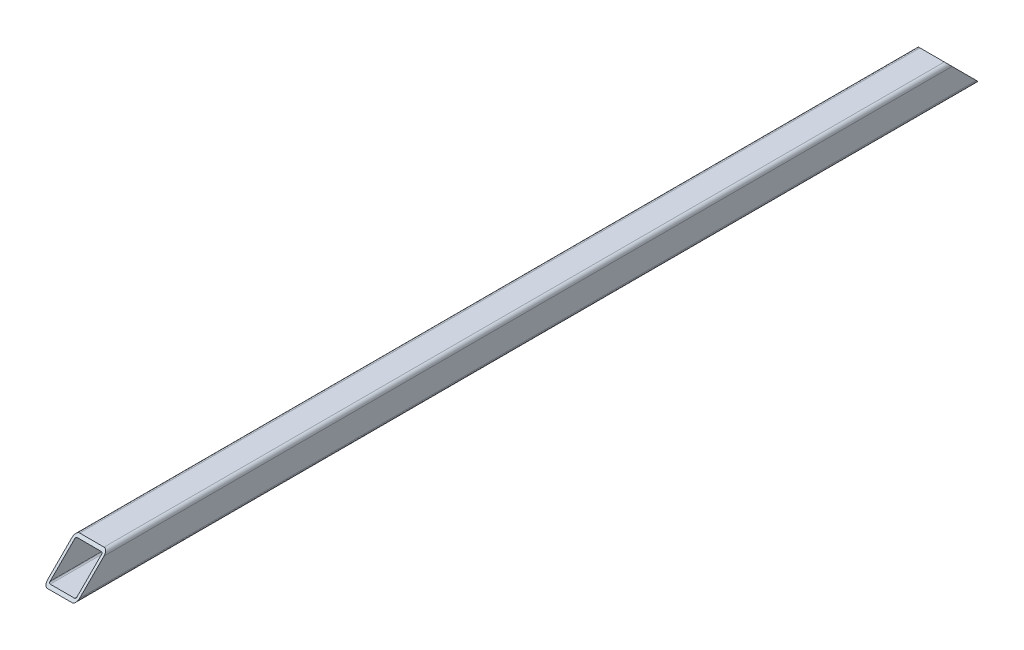
ISO-10303-21;
HEADER;
FILE_DESCRIPTION(('STEP AP214'),'2;1');
FILE_NAME('part.step','',(''),(''),'','','');
FILE_SCHEMA(('AUTOMOTIVE_DESIGN { 1 0 10303 214 1 1 1 1 }'));
ENDSEC;
DATA;
#1=APPLICATION_CONTEXT('core data for automotive mechanical design processes');
#2=APPLICATION_PROTOCOL_DEFINITION('international standard','automotive_design',2000,#1);
#3=PRODUCT_CONTEXT('',#1,'mechanical');
#4=PRODUCT('Part','Part','',(#3));
#5=PRODUCT_RELATED_PRODUCT_CATEGORY('part','',(#4));
#6=PRODUCT_DEFINITION_FORMATION('','',#4);
#7=PRODUCT_DEFINITION_CONTEXT('part definition',#1,'design');
#8=PRODUCT_DEFINITION('design','',#6,#7);
#9=PRODUCT_DEFINITION_SHAPE('','',#8);
#10=(LENGTH_UNIT() NAMED_UNIT(*) SI_UNIT(.MILLI.,.METRE.));
#11=(NAMED_UNIT(*) PLANE_ANGLE_UNIT() SI_UNIT($,.RADIAN.));
#12=(NAMED_UNIT(*) SI_UNIT($,.STERADIAN.) SOLID_ANGLE_UNIT());
#13=UNCERTAINTY_MEASURE_WITH_UNIT(LENGTH_MEASURE(1.E-05),#10,'distance_accuracy_value','');
#14=(GEOMETRIC_REPRESENTATION_CONTEXT(3) GLOBAL_UNCERTAINTY_ASSIGNED_CONTEXT((#13)) GLOBAL_UNIT_ASSIGNED_CONTEXT((#10,
#11,#12)) REPRESENTATION_CONTEXT('',''));
#15=CARTESIAN_POINT('',(0.,0.,0.));
#16=DIRECTION('',(0.,0.,1.));
#17=DIRECTION('',(1.,0.,0.));
#18=AXIS2_PLACEMENT_3D('',#15,#16,#17);
#19=CARTESIAN_POINT('',(-9.49999999999648,-9.50000000000021,1.05693231944315E-12));
#20=DIRECTION('',(0.,0.,1.));
#21=DIRECTION('',(1.,0.,0.));
#22=AXIS2_PLACEMENT_3D('',#19,#20,#21);
#23=CYLINDRICAL_SURFACE('',#22,3.);
#24=CARTESIAN_POINT('',(-9.49999999999648,-9.50000000000021,-9.49999999773317));
#25=DIRECTION('',(0.,-0.707106781102224,0.707106781270871));
#26=DIRECTION('',(0.,0.707106781270871,0.707106781102224));
#27=AXIS2_PLACEMENT_3D('',#24,#25,#26);
#28=ELLIPSE('',#27,4.24264068661334,3.);
#29=CARTESIAN_POINT('',(-12.4999999999964,-9.50000000000021,-9.49999999773315));
#30=VERTEX_POINT('',#29);
#31=CARTESIAN_POINT('',(-9.49999999999648,-12.5000000000002,-12.5000000999989));
#32=VERTEX_POINT('',#31);
#33=EDGE_CURVE('E211',#30,#32,#28,.T.);
#34=ORIENTED_EDGE('',*,*,#33,.T.);
#35=DIRECTION('',(0.,0.,1.));
#36=VECTOR('',#35,1.);
#37=CARTESIAN_POINT('',(-9.49999999999648,-12.5000000000002,1.05693231944315E-12));
#38=LINE('',#37,#36);
#39=CARTESIAN_POINT('',(-9.49999999999356,-12.5000000000002,692.500000100001));
#40=VERTEX_POINT('',#39);
#41=EDGE_CURVE('E11',#32,#40,#38,.T.);
#42=ORIENTED_EDGE('',*,*,#41,.T.);
#43=CARTESIAN_POINT('',(-9.49999999999363,-9.50000000000021,689.500000003603));
#44=DIRECTION('',(0.,-0.707106781320614,-0.707106781052481));
#45=DIRECTION('',(0.,0.707106781052481,-0.707106781320614));
#46=AXIS2_PLACEMENT_3D('',#43,#44,#45);
#47=ELLIPSE('',#46,4.24264068792368,3.);
#48=CARTESIAN_POINT('',(-12.4999999999936,-9.50000000000021,689.500000003603));
#49=VERTEX_POINT('',#48);
#50=EDGE_CURVE('E278',#40,#49,#47,.T.);
#51=ORIENTED_EDGE('',*,*,#50,.T.);
#52=DIRECTION('',(0.,0.,-1.));
#53=VECTOR('',#52,1.);
#54=CARTESIAN_POINT('',(-12.4999999999964,-9.50000000000021,1.06581410364015E-12));
#55=LINE('',#54,#53);
#56=EDGE_CURVE('E267',#49,#30,#55,.T.);
#57=ORIENTED_EDGE('',*,*,#56,.T.);
#58=EDGE_LOOP('',(#34,#42,#51,#57));
#59=FACE_BOUND('',#58,.T.);
#60=ADVANCED_FACE('F16',(#59),#23,.T.);
#61=CARTESIAN_POINT('',(9.50000000000358,-12.5000000000002,9.76996261670138E-13));
#62=DIRECTION('',(0.,-1.,0.));
#63=DIRECTION('',(-1.,0.,0.));
#64=AXIS2_PLACEMENT_3D('',#61,#62,#63);
#65=PLANE('',#64);
#66=DIRECTION('',(-1.,0.,0.));
#67=VECTOR('',#66,1.);
#68=CARTESIAN_POINT('',(4.75000000000641,-12.5000000000002,692.500000100001));
#69=LINE('',#68,#67);
#70=CARTESIAN_POINT('',(9.50000000000642,-12.5000000000002,692.500000100001));
#71=VERTEX_POINT('',#70);
#72=EDGE_CURVE('E275',#71,#40,#69,.T.);
#73=ORIENTED_EDGE('',*,*,#72,.T.);
#74=ORIENTED_EDGE('',*,*,#41,.F.);
#75=DIRECTION('',(-1.,0.,0.));
#76=VECTOR('',#75,1.);
#77=CARTESIAN_POINT('',(4.7500000000035,-12.5000000000002,-12.500000099999));
#78=LINE('',#77,#76);
#79=CARTESIAN_POINT('',(9.50000000000351,-12.5000000000002,-12.500000099999));
#80=VERTEX_POINT('',#79);
#81=EDGE_CURVE('E229',#80,#32,#78,.T.);
#82=ORIENTED_EDGE('',*,*,#81,.F.);
#83=DIRECTION('',(0.,0.,-1.));
#84=VECTOR('',#83,1.);
#85=CARTESIAN_POINT('',(9.50000000000358,-12.5000000000002,9.76996261670138E-13));
#86=LINE('',#85,#84);
#87=EDGE_CURVE('E27',#71,#80,#86,.T.);
#88=ORIENTED_EDGE('',*,*,#87,.F.);
#89=EDGE_LOOP('',(#73,#74,#82,#88));
#90=FACE_BOUND('',#89,.T.);
#91=ADVANCED_FACE('F392',(#90),#65,.T.);
#92=CARTESIAN_POINT('',(9.50000000000358,-9.50000000000022,9.76996261670138E-13));
#93=DIRECTION('',(0.,0.,1.));
#94=DIRECTION('',(0.,1.,0.));
#95=AXIS2_PLACEMENT_3D('',#92,#93,#94);
#96=CYLINDRICAL_SURFACE('',#95,3.);
#97=CARTESIAN_POINT('',(9.50000000000351,-9.50000000000021,-9.49999999773324));
#98=DIRECTION('',(0.,-0.707106781102224,0.707106781270871));
#99=DIRECTION('',(0.,0.707106781270871,0.707106781102224));
#100=AXIS2_PLACEMENT_3D('',#97,#98,#99);
#101=ELLIPSE('',#100,4.24264068661334,3.);
#102=CARTESIAN_POINT('',(12.5000000000036,-9.50000000000021,-9.49999999773325));
#103=VERTEX_POINT('',#102);
#104=EDGE_CURVE('E284',#80,#103,#101,.T.);
#105=ORIENTED_EDGE('',*,*,#104,.T.);
#106=DIRECTION('',(0.,0.,-1.));
#107=VECTOR('',#106,1.);
#108=CARTESIAN_POINT('',(12.5000000000036,-9.50000000000022,9.59232693276135E-13));
#109=LINE('',#108,#107);
#110=CARTESIAN_POINT('',(12.5000000000064,-9.50000000000021,689.500000003603));
#111=VERTEX_POINT('',#110);
#112=EDGE_CURVE('E252',#111,#103,#109,.T.);
#113=ORIENTED_EDGE('',*,*,#112,.F.);
#114=CARTESIAN_POINT('',(9.50000000000642,-9.50000000000021,689.500000003603));
#115=DIRECTION('',(0.,-0.707106781320614,-0.707106781052481));
#116=DIRECTION('',(0.,0.707106781052481,-0.707106781320614));
#117=AXIS2_PLACEMENT_3D('',#114,#115,#116);
#118=ELLIPSE('',#117,4.24264068792368,3.);
#119=EDGE_CURVE('E268',#111,#71,#118,.T.);
#120=ORIENTED_EDGE('',*,*,#119,.T.);
#121=ORIENTED_EDGE('',*,*,#87,.T.);
#122=EDGE_LOOP('',(#105,#113,#120,#121));
#123=FACE_BOUND('',#122,.T.);
#124=ADVANCED_FACE('F386',(#123),#96,.T.);
#125=CARTESIAN_POINT('',(9.50000000000358,9.49999999999978,9.68114477473137E-13));
#126=DIRECTION('',(0.,0.,1.));
#127=DIRECTION('',(-1.,0.,0.));
#128=AXIS2_PLACEMENT_3D('',#125,#126,#127);
#129=CYLINDRICAL_SURFACE('',#128,1.);
#130=CARTESIAN_POINT('',(9.50000000000358,9.49999999999979,9.49999999773518));
#131=DIRECTION('',(0.,0.707106781102224,-0.707106781270871));
#132=DIRECTION('',(0.,-0.707106781270871,-0.707106781102224));
#133=AXIS2_PLACEMENT_3D('',#130,#131,#132);
#134=ELLIPSE('',#133,1.41421356220445,1.);
#135=CARTESIAN_POINT('',(9.50000000000358,10.4999999999998,10.4999999974967));
#136=VERTEX_POINT('',#135);
#137=CARTESIAN_POINT('',(10.5000000000036,9.49999999999978,9.49999999773517));
#138=VERTEX_POINT('',#137);
#139=EDGE_CURVE('E213',#136,#138,#134,.T.);
#140=ORIENTED_EDGE('',*,*,#139,.T.);
#141=DIRECTION('',(0.,0.,-1.));
#142=VECTOR('',#141,1.);
#143=CARTESIAN_POINT('',(10.5000000000035,9.49999999999978,9.68114477473137E-13));
#144=LINE('',#143,#142);
#145=CARTESIAN_POINT('',(10.5000000000063,9.49999999999978,670.499999996398));
#146=VERTEX_POINT('',#145);
#147=EDGE_CURVE('E282',#146,#138,#144,.T.);
#148=ORIENTED_EDGE('',*,*,#147,.F.);
#149=CARTESIAN_POINT('',(9.50000000000628,9.49999999999978,670.499999996398));
#150=DIRECTION('',(0.,0.707106781320614,0.707106781052481));
#151=DIRECTION('',(0.,-0.707106781052481,0.707106781320614));
#152=AXIS2_PLACEMENT_3D('',#149,#150,#151);
#153=ELLIPSE('',#152,1.41421356264123,1.);
#154=CARTESIAN_POINT('',(9.50000000000628,10.4999999999998,669.499999996019));
#155=VERTEX_POINT('',#154);
#156=EDGE_CURVE('E326',#146,#155,#153,.T.);
#157=ORIENTED_EDGE('',*,*,#156,.T.);
#158=DIRECTION('',(0.,0.,-1.));
#159=VECTOR('',#158,1.);
#160=CARTESIAN_POINT('',(9.50000000000358,10.4999999999998,9.76996261670138E-13));
#161=LINE('',#160,#159);
#162=EDGE_CURVE('E140',#155,#136,#161,.T.);
#163=ORIENTED_EDGE('',*,*,#162,.T.);
#164=EDGE_LOOP('',(#140,#148,#157,#163));
#165=FACE_BOUND('',#164,.T.);
#166=ADVANCED_FACE('F663',(#165),#129,.F.);
#167=CARTESIAN_POINT('',(10.5000000000035,9.49999999999978,9.68114477473137E-13));
#168=DIRECTION('',(1.,0.,0.));
#169=DIRECTION('',(0.,0.,-1.));
#170=AXIS2_PLACEMENT_3D('',#167,#168,#169);
#171=PLANE('',#170);
#172=DIRECTION('',(0.,-0.707106781270871,-0.707106781102224));
#173=VECTOR('',#172,1.);
#174=CARTESIAN_POINT('',(10.5000000000035,2.37500000056623,2.37500000000097));
#175=LINE('',#174,#173);
#176=CARTESIAN_POINT('',(10.5000000000035,-9.50000000000021,-9.49999999773324));
#177=VERTEX_POINT('',#176);
#178=EDGE_CURVE('E220',#138,#177,#175,.T.);
#179=ORIENTED_EDGE('',*,*,#178,.T.);
#180=DIRECTION('',(0.,0.,-1.));
#181=VECTOR('',#180,1.);
#182=CARTESIAN_POINT('',(10.5000000000035,-9.50000000000022,9.68114477473137E-13));
#183=LINE('',#182,#181);
#184=CARTESIAN_POINT('',(10.5000000000064,-9.50000000000021,689.500000003603));
#185=VERTEX_POINT('',#184);
#186=EDGE_CURVE('E279',#185,#177,#183,.T.);
#187=ORIENTED_EDGE('',*,*,#186,.F.);
#188=DIRECTION('',(0.,0.707106781052481,-0.707106781320614));
#189=VECTOR('',#188,1.);
#190=CARTESIAN_POINT('',(10.5000000000052,342.374999999099,337.624999871074));
#191=LINE('',#190,#189);
#192=EDGE_CURVE('E321',#185,#146,#191,.T.);
#193=ORIENTED_EDGE('',*,*,#192,.T.);
#194=ORIENTED_EDGE('',*,*,#147,.T.);
#195=EDGE_LOOP('',(#179,#187,#193,#194));
#196=FACE_BOUND('',#195,.T.);
#197=ADVANCED_FACE('F654',(#196),#171,.F.);
#198=CARTESIAN_POINT('',(9.50000000000358,-9.50000000000022,9.76996261670138E-13));
#199=DIRECTION('',(0.,0.,1.));
#200=DIRECTION('',(0.,1.,0.));
#201=AXIS2_PLACEMENT_3D('',#198,#199,#200);
#202=CYLINDRICAL_SURFACE('',#201,1.);
#203=CARTESIAN_POINT('',(9.50000000000351,-9.50000000000021,-9.49999999773324));
#204=DIRECTION('',(0.,0.707106781102224,-0.707106781270871));
#205=DIRECTION('',(0.,0.707106781270871,0.707106781102224));
#206=AXIS2_PLACEMENT_3D('',#203,#204,#205);
#207=ELLIPSE('',#206,1.41421356220445,1.);
#208=CARTESIAN_POINT('',(9.50000000000351,-10.5000000000002,-10.4999999974947));
#209=VERTEX_POINT('',#208);
#210=EDGE_CURVE('E20',#177,#209,#207,.T.);
#211=ORIENTED_EDGE('',*,*,#210,.T.);
#212=DIRECTION('',(0.,0.,-1.));
#213=VECTOR('',#212,1.);
#214=CARTESIAN_POINT('',(9.50000000000358,-10.5000000000002,9.68114477473137E-13));
#215=LINE('',#214,#213);
#216=CARTESIAN_POINT('',(9.50000000000642,-10.5000000000002,690.500000003982));
#217=VERTEX_POINT('',#216);
#218=EDGE_CURVE('E236',#217,#209,#215,.T.);
#219=ORIENTED_EDGE('',*,*,#218,.F.);
#220=CARTESIAN_POINT('',(9.50000000000642,-9.50000000000021,689.500000003603));
#221=DIRECTION('',(0.,0.707106781320614,0.707106781052481));
#222=DIRECTION('',(0.,0.707106781052481,-0.707106781320614));
#223=AXIS2_PLACEMENT_3D('',#220,#221,#222);
#224=ELLIPSE('',#223,1.41421356264123,1.);
#225=EDGE_CURVE('E325',#217,#185,#224,.T.);
#226=ORIENTED_EDGE('',*,*,#225,.T.);
#227=ORIENTED_EDGE('',*,*,#186,.T.);
#228=EDGE_LOOP('',(#211,#219,#226,#227));
#229=FACE_BOUND('',#228,.T.);
#230=ADVANCED_FACE('F644',(#229),#202,.F.);
#231=CARTESIAN_POINT('',(-12.4999999999964,-9.50000000000021,1.06581410364015E-12));
#232=DIRECTION('',(-1.,0.,0.));
#233=DIRECTION('',(0.,1.,0.));
#234=AXIS2_PLACEMENT_3D('',#231,#232,#233);
#235=PLANE('',#234);
#236=DIRECTION('',(0.,-0.707106781270871,-0.707106781102224));
#237=VECTOR('',#236,1.);
#238=CARTESIAN_POINT('',(-12.4999999999964,-2.37500000056665,-2.37499999999894));
#239=LINE('',#238,#237);
#240=CARTESIAN_POINT('',(-12.4999999999964,9.49999999999979,9.49999999773526));
#241=VERTEX_POINT('',#240);
#242=EDGE_CURVE('E189',#241,#30,#239,.T.);
#243=ORIENTED_EDGE('',*,*,#242,.T.);
#244=ORIENTED_EDGE('',*,*,#56,.F.);
#245=DIRECTION('',(0.,0.707106781052481,-0.707106781320614));
#246=VECTOR('',#245,1.);
#247=CARTESIAN_POINT('',(-12.4999999999949,337.6250000009,342.374999871074));
#248=LINE('',#247,#246);
#249=CARTESIAN_POINT('',(-12.4999999999937,9.49999999999979,670.499999996399));
#250=VERTEX_POINT('',#249);
#251=EDGE_CURVE('E151',#49,#250,#248,.T.);
#252=ORIENTED_EDGE('',*,*,#251,.T.);
#253=DIRECTION('',(0.,0.,-1.));
#254=VECTOR('',#253,1.);
#255=CARTESIAN_POINT('',(-12.4999999999964,9.49999999999979,1.06581410364015E-12));
#256=LINE('',#255,#254);
#257=EDGE_CURVE('E184',#250,#241,#256,.T.);
#258=ORIENTED_EDGE('',*,*,#257,.T.);
#259=EDGE_LOOP('',(#243,#244,#252,#258));
#260=FACE_BOUND('',#259,.T.);
#261=CARTESIAN_POINT('',(-12.4999999999953,2.9999982171168,289.332555752318));
#262=DIRECTION('',(1.,0.,0.));
#263=DIRECTION('',(0.,-1.,0.));
#264=AXIS2_PLACEMENT_3D('',#261,#262,#263);
#265=CIRCLE('',#264,3.3235);
#266=CARTESIAN_POINT('',(-12.4999999999953,-0.3235017828832,289.332555752318));
#267=VERTEX_POINT('',#266);
#268=EDGE_CURVE('E259',#267,#267,#265,.T.);
#269=ORIENTED_EDGE('',*,*,#268,.T.);
#270=EDGE_LOOP('',(#269));
#271=FACE_BOUND('',#270,.T.);
#272=CARTESIAN_POINT('',(-12.4999999999967,2.9999982171186,179.33255575236));
#273=DIRECTION('',(1.,0.,0.));
#274=DIRECTION('',(0.,-1.,0.));
#275=AXIS2_PLACEMENT_3D('',#272,#273,#274);
#276=CIRCLE('',#275,3.3235);
#277=CARTESIAN_POINT('',(-12.4999999999967,6.3234982171186,179.33255575236));
#278=VERTEX_POINT('',#277);
#279=EDGE_CURVE('E240',#278,#278,#276,.T.);
#280=ORIENTED_EDGE('',*,*,#279,.T.);
#281=EDGE_LOOP('',(#280));
#282=FACE_BOUND('',#281,.T.);
#283=ADVANCED_FACE('F186',(#260,#271,#282),#235,.T.);
#284=CARTESIAN_POINT('',(-9.49999999999648,10.4999999999998,1.05693231944315E-12));
#285=DIRECTION('',(0.,1.,0.));
#286=DIRECTION('',(1.,0.,0.));
#287=AXIS2_PLACEMENT_3D('',#284,#285,#286);
#288=PLANE('',#287);
#289=DIRECTION('',(1.,0.,0.));
#290=VECTOR('',#289,1.);
#291=CARTESIAN_POINT('',(-4.74999999999646,10.4999999999998,10.4999999974967));
#292=LINE('',#291,#290);
#293=CARTESIAN_POINT('',(-9.4999999999964,10.4999999999998,10.4999999974968));
#294=VERTEX_POINT('',#293);
#295=EDGE_CURVE('E224',#294,#136,#292,.T.);
#296=ORIENTED_EDGE('',*,*,#295,.T.);
#297=ORIENTED_EDGE('',*,*,#162,.F.);
#298=DIRECTION('',(-1.,0.,0.));
#299=VECTOR('',#298,1.);
#300=CARTESIAN_POINT('',(-4.74999999999355,10.4999999999997,669.49999999602));
#301=LINE('',#300,#299);
#302=CARTESIAN_POINT('',(-9.4999999999937,10.4999999999998,669.49999999602));
#303=VERTEX_POINT('',#302);
#304=EDGE_CURVE('E231',#155,#303,#301,.T.);
#305=ORIENTED_EDGE('',*,*,#304,.T.);
#306=DIRECTION('',(0.,0.,-1.));
#307=VECTOR('',#306,1.);
#308=CARTESIAN_POINT('',(-9.49999999999648,10.4999999999998,1.05693231944315E-12));
#309=LINE('',#308,#307);
#310=EDGE_CURVE('E317',#303,#294,#309,.T.);
#311=ORIENTED_EDGE('',*,*,#310,.T.);
#312=EDGE_LOOP('',(#296,#297,#305,#311));
#313=FACE_BOUND('',#312,.T.);
#314=ADVANCED_FACE('F18',(#313),#288,.F.);
#315=CARTESIAN_POINT('',(5.11590769747272E-12,340.,339.999999871074));
#316=DIRECTION('',(0.,-0.707106781320614,-0.707106781052481));
#317=DIRECTION('',(0.,0.707106781052481,-0.707106781320614));
#318=AXIS2_PLACEMENT_3D('',#315,#316,#317);
#319=PLANE('',#318);
#320=DIRECTION('',(0.,-0.707106781052481,0.707106781320614));
#321=VECTOR('',#320,1.);
#322=CARTESIAN_POINT('',(12.5000000000051,342.374999999099,337.624999871074));
#323=LINE('',#322,#321);
#324=CARTESIAN_POINT('',(12.5000000000063,9.49999999999978,670.499999996398));
#325=VERTEX_POINT('',#324);
#326=EDGE_CURVE('E248',#325,#111,#323,.T.);
#327=ORIENTED_EDGE('',*,*,#326,.F.);
#328=CARTESIAN_POINT('',(9.50000000000628,9.49999999999978,670.499999996398));
#329=DIRECTION('',(0.,-0.707106781320614,-0.707106781052481));
#330=DIRECTION('',(0.,-0.707106781052481,0.707106781320614));
#331=AXIS2_PLACEMENT_3D('',#328,#329,#330);
#332=ELLIPSE('',#331,4.24264068792368,3.);
#333=CARTESIAN_POINT('',(9.50000000000628,12.4999999999998,667.499999995261));
#334=VERTEX_POINT('',#333);
#335=EDGE_CURVE('E318',#334,#325,#332,.T.);
#336=ORIENTED_EDGE('',*,*,#335,.F.);
#337=DIRECTION('',(1.,0.,0.));
#338=VECTOR('',#337,1.);
#339=CARTESIAN_POINT('',(-4.74999999999362,12.4999999999997,667.499999995261));
#340=LINE('',#339,#338);
#341=CARTESIAN_POINT('',(-9.4999999999937,12.4999999999998,667.499999995261));
#342=VERTEX_POINT('',#341);
#343=EDGE_CURVE('E193',#342,#334,#340,.T.);
#344=ORIENTED_EDGE('',*,*,#343,.F.);
#345=CARTESIAN_POINT('',(-9.4999999999937,9.49999999999979,670.499999996399));
#346=DIRECTION('',(0.,-0.707106781320614,-0.707106781052481));
#347=DIRECTION('',(0.,-0.707106781052481,0.707106781320614));
#348=AXIS2_PLACEMENT_3D('',#345,#346,#347);
#349=ELLIPSE('',#348,4.24264068792368,3.);
#350=EDGE_CURVE('E192',#250,#342,#349,.T.);
#351=ORIENTED_EDGE('',*,*,#350,.F.);
#352=ORIENTED_EDGE('',*,*,#251,.F.);
#353=ORIENTED_EDGE('',*,*,#50,.F.);
#354=ORIENTED_EDGE('',*,*,#72,.F.);
#355=ORIENTED_EDGE('',*,*,#119,.F.);
#356=EDGE_LOOP('',(#327,#336,#344,#351,#352,#353,#354,#355));
#357=FACE_BOUND('',#356,.T.);
#358=DIRECTION('',(1.,0.,0.));
#359=VECTOR('',#358,1.);
#360=CARTESIAN_POINT('',(4.75000000000655,-10.5000000000002,690.500000003982));
#361=LINE('',#360,#359);
#362=CARTESIAN_POINT('',(-9.49999999999363,-10.5000000000002,690.500000003983));
#363=VERTEX_POINT('',#362);
#364=EDGE_CURVE('E235',#363,#217,#361,.T.);
#365=ORIENTED_EDGE('',*,*,#364,.F.);
#366=CARTESIAN_POINT('',(-9.49999999999363,-9.50000000000021,689.500000003603));
#367=DIRECTION('',(0.,0.707106781320614,0.707106781052481));
#368=DIRECTION('',(0.,0.707106781052481,-0.707106781320614));
#369=AXIS2_PLACEMENT_3D('',#366,#367,#368);
#370=ELLIPSE('',#369,1.41421356264123,1.);
#371=CARTESIAN_POINT('',(-10.4999999999936,-9.50000000000021,689.500000003603));
#372=VERTEX_POINT('',#371);
#373=EDGE_CURVE('E274',#372,#363,#370,.T.);
#374=ORIENTED_EDGE('',*,*,#373,.F.);
#375=DIRECTION('',(0.,-0.707106781052481,0.707106781320614));
#376=VECTOR('',#375,1.);
#377=CARTESIAN_POINT('',(-10.4999999999949,337.6250000009,342.374999871074));
#378=LINE('',#377,#376);
#379=CARTESIAN_POINT('',(-10.4999999999937,9.49999999999979,670.499999996399));
#380=VERTEX_POINT('',#379);
#381=EDGE_CURVE('E273',#380,#372,#378,.T.);
#382=ORIENTED_EDGE('',*,*,#381,.F.);
#383=CARTESIAN_POINT('',(-9.4999999999937,9.49999999999979,670.499999996399));
#384=DIRECTION('',(0.,0.707106781320614,0.707106781052481));
#385=DIRECTION('',(0.,-0.707106781052481,0.707106781320614));
#386=AXIS2_PLACEMENT_3D('',#383,#384,#385);
#387=ELLIPSE('',#386,1.41421356264123,1.);
#388=EDGE_CURVE('E314',#303,#380,#387,.T.);
#389=ORIENTED_EDGE('',*,*,#388,.F.);
#390=ORIENTED_EDGE('',*,*,#304,.F.);
#391=ORIENTED_EDGE('',*,*,#156,.F.);
#392=ORIENTED_EDGE('',*,*,#192,.F.);
#393=ORIENTED_EDGE('',*,*,#225,.F.);
#394=EDGE_LOOP('',(#365,#374,#382,#389,#390,#391,#392,#393));
#395=FACE_BOUND('',#394,.T.);
#396=ADVANCED_FACE('F390',(#357,#395),#319,.F.);
#397=CARTESIAN_POINT('',(-9.49999999999648,9.49999999999979,1.04805053524615E-12));
#398=DIRECTION('',(0.,0.,1.));
#399=DIRECTION('',(0.,-1.,0.));
#400=AXIS2_PLACEMENT_3D('',#397,#398,#399);
#401=CYLINDRICAL_SURFACE('',#400,3.);
#402=CARTESIAN_POINT('',(-9.4999999999964,9.49999999999979,9.49999999773526));
#403=DIRECTION('',(0.,-0.707106781102224,0.707106781270871));
#404=DIRECTION('',(0.,-0.707106781270871,-0.707106781102224));
#405=AXIS2_PLACEMENT_3D('',#402,#403,#404);
#406=ELLIPSE('',#405,4.24264068661334,3.);
#407=CARTESIAN_POINT('',(-9.4999999999964,12.4999999999998,12.4999999970197));
#408=VERTEX_POINT('',#407);
#409=EDGE_CURVE('E196',#408,#241,#406,.T.);
#410=ORIENTED_EDGE('',*,*,#409,.T.);
#411=ORIENTED_EDGE('',*,*,#257,.F.);
#412=ORIENTED_EDGE('',*,*,#350,.T.);
#413=DIRECTION('',(0.,0.,-1.));
#414=VECTOR('',#413,1.);
#415=CARTESIAN_POINT('',(-9.49999999999648,12.4999999999998,1.04805053524615E-12));
#416=LINE('',#415,#414);
#417=EDGE_CURVE('E199',#342,#408,#416,.T.);
#418=ORIENTED_EDGE('',*,*,#417,.T.);
#419=EDGE_LOOP('',(#410,#411,#412,#418));
#420=FACE_BOUND('',#419,.T.);
#421=ADVANCED_FACE('F197',(#420),#401,.T.);
#422=CARTESIAN_POINT('',(-9.49999999999648,12.4999999999998,1.04805053524615E-12));
#423=DIRECTION('',(0.,1.,0.));
#424=DIRECTION('',(1.,0.,0.));
#425=AXIS2_PLACEMENT_3D('',#422,#423,#424);
#426=PLANE('',#425);
#427=DIRECTION('',(-1.,0.,0.));
#428=VECTOR('',#427,1.);
#429=CARTESIAN_POINT('',(-4.74999999999639,12.4999999999998,12.4999999970197));
#430=LINE('',#429,#428);
#431=CARTESIAN_POINT('',(9.50000000000358,12.4999999999998,12.4999999970197));
#432=VERTEX_POINT('',#431);
#433=EDGE_CURVE('E204',#432,#408,#430,.T.);
#434=ORIENTED_EDGE('',*,*,#433,.T.);
#435=ORIENTED_EDGE('',*,*,#417,.F.);
#436=ORIENTED_EDGE('',*,*,#343,.T.);
#437=DIRECTION('',(0.,0.,-1.));
#438=VECTOR('',#437,1.);
#439=CARTESIAN_POINT('',(9.50000000000358,12.4999999999998,9.68114477473137E-13));
#440=LINE('',#439,#438);
#441=EDGE_CURVE('E292',#334,#432,#440,.T.);
#442=ORIENTED_EDGE('',*,*,#441,.T.);
#443=EDGE_LOOP('',(#434,#435,#436,#442));
#444=FACE_BOUND('',#443,.T.);
#445=ADVANCED_FACE('F601',(#444),#426,.T.);
#446=CARTESIAN_POINT('',(9.50000000000358,9.49999999999978,9.68114477473137E-13));
#447=DIRECTION('',(0.,0.,1.));
#448=DIRECTION('',(-1.,0.,0.));
#449=AXIS2_PLACEMENT_3D('',#446,#447,#448);
#450=CYLINDRICAL_SURFACE('',#449,3.);
#451=CARTESIAN_POINT('',(9.50000000000358,9.49999999999979,9.49999999773518));
#452=DIRECTION('',(0.,-0.707106781102224,0.707106781270871));
#453=DIRECTION('',(0.,-0.707106781270871,-0.707106781102224));
#454=AXIS2_PLACEMENT_3D('',#451,#452,#453);
#455=ELLIPSE('',#454,4.24264068661334,3.);
#456=CARTESIAN_POINT('',(12.5000000000036,9.49999999999978,9.49999999773516));
#457=VERTEX_POINT('',#456);
#458=EDGE_CURVE('E260',#457,#432,#455,.T.);
#459=ORIENTED_EDGE('',*,*,#458,.T.);
#460=ORIENTED_EDGE('',*,*,#441,.F.);
#461=ORIENTED_EDGE('',*,*,#335,.T.);
#462=DIRECTION('',(0.,0.,-1.));
#463=VECTOR('',#462,1.);
#464=CARTESIAN_POINT('',(12.5000000000036,9.49999999999978,9.59232693276135E-13));
#465=LINE('',#464,#463);
#466=EDGE_CURVE('E253',#325,#457,#465,.T.);
#467=ORIENTED_EDGE('',*,*,#466,.T.);
#468=EDGE_LOOP('',(#459,#460,#461,#467));
#469=FACE_BOUND('',#468,.T.);
#470=ADVANCED_FACE('F404',(#469),#450,.T.);
#471=CARTESIAN_POINT('',(12.5000000000036,9.49999999999978,9.59232693276135E-13));
#472=DIRECTION('',(1.,0.,0.));
#473=DIRECTION('',(0.,0.,-1.));
#474=AXIS2_PLACEMENT_3D('',#471,#472,#473);
#475=PLANE('',#474);
#476=DIRECTION('',(0.,0.707106781270871,0.707106781102224));
#477=VECTOR('',#476,1.);
#478=CARTESIAN_POINT('',(12.5000000000036,2.37500000056623,2.37500000000096));
#479=LINE('',#478,#477);
#480=EDGE_CURVE('E264',#103,#457,#479,.T.);
#481=ORIENTED_EDGE('',*,*,#480,.T.);
#482=ORIENTED_EDGE('',*,*,#466,.F.);
#483=ORIENTED_EDGE('',*,*,#326,.T.);
#484=ORIENTED_EDGE('',*,*,#112,.T.);
#485=EDGE_LOOP('',(#481,#482,#483,#484));
#486=FACE_BOUND('',#485,.T.);
#487=ADVANCED_FACE('F399',(#486),#475,.T.);
#488=CARTESIAN_POINT('',(-9.49999999999648,9.49999999999979,1.04805053524615E-12));
#489=DIRECTION('',(0.,0.,1.));
#490=DIRECTION('',(0.,-1.,0.));
#491=AXIS2_PLACEMENT_3D('',#488,#489,#490);
#492=CYLINDRICAL_SURFACE('',#491,1.);
#493=CARTESIAN_POINT('',(-9.4999999999964,9.49999999999979,9.49999999773526));
#494=DIRECTION('',(0.,0.707106781102224,-0.707106781270871));
#495=DIRECTION('',(0.,-0.707106781270871,-0.707106781102224));
#496=AXIS2_PLACEMENT_3D('',#493,#494,#495);
#497=ELLIPSE('',#496,1.41421356220445,1.);
#498=CARTESIAN_POINT('',(-10.4999999999964,9.4999999999998,9.49999999773526));
#499=VERTEX_POINT('',#498);
#500=EDGE_CURVE('E303',#499,#294,#497,.T.);
#501=ORIENTED_EDGE('',*,*,#500,.T.);
#502=ORIENTED_EDGE('',*,*,#310,.F.);
#503=ORIENTED_EDGE('',*,*,#388,.T.);
#504=DIRECTION('',(0.,0.,1.));
#505=VECTOR('',#504,1.);
#506=CARTESIAN_POINT('',(-10.4999999999964,9.4999999999998,1.05693231944315E-12));
#507=LINE('',#506,#505);
#508=EDGE_CURVE('E269',#499,#380,#507,.T.);
#509=ORIENTED_EDGE('',*,*,#508,.F.);
#510=EDGE_LOOP('',(#501,#502,#503,#509));
#511=FACE_BOUND('',#510,.T.);
#512=ADVANCED_FACE('F571',(#511),#492,.F.);
#513=CARTESIAN_POINT('',(-10.4999999999964,-9.50000000000021,1.05693231944315E-12));
#514=DIRECTION('',(-1.,0.,0.));
#515=DIRECTION('',(0.,1.,0.));
#516=AXIS2_PLACEMENT_3D('',#513,#514,#515);
#517=PLANE('',#516);
#518=DIRECTION('',(0.,0.707106781270871,0.707106781102224));
#519=VECTOR('',#518,1.);
#520=CARTESIAN_POINT('',(-10.4999999999964,-2.37500000056665,-2.37499999999895));
#521=LINE('',#520,#519);
#522=CARTESIAN_POINT('',(-10.4999999999965,-9.50000000000021,-9.49999999773316));
#523=VERTEX_POINT('',#522);
#524=EDGE_CURVE('E298',#523,#499,#521,.T.);
#525=ORIENTED_EDGE('',*,*,#524,.T.);
#526=ORIENTED_EDGE('',*,*,#508,.T.);
#527=ORIENTED_EDGE('',*,*,#381,.T.);
#528=DIRECTION('',(0.,0.,-1.));
#529=VECTOR('',#528,1.);
#530=CARTESIAN_POINT('',(-10.4999999999964,-9.50000000000021,1.05693231944315E-12));
#531=LINE('',#530,#529);
#532=EDGE_CURVE('E239',#372,#523,#531,.T.);
#533=ORIENTED_EDGE('',*,*,#532,.T.);
#534=EDGE_LOOP('',(#525,#526,#527,#533));
#535=FACE_BOUND('',#534,.T.);
#536=CARTESIAN_POINT('',(-10.4999999999953,2.9999982171168,289.332555752318));
#537=DIRECTION('',(-1.,0.,0.));
#538=DIRECTION('',(0.,-1.,0.));
#539=AXIS2_PLACEMENT_3D('',#536,#537,#538);
#540=CIRCLE('',#539,3.3235);
#541=CARTESIAN_POINT('',(-10.4999999999953,6.3234982171168,289.332555752318));
#542=VERTEX_POINT('',#541);
#543=EDGE_CURVE('E243',#542,#542,#540,.T.);
#544=ORIENTED_EDGE('',*,*,#543,.T.);
#545=EDGE_LOOP('',(#544));
#546=FACE_BOUND('',#545,.T.);
#547=CARTESIAN_POINT('',(-10.4999999999966,2.99999821711859,179.33255575236));
#548=DIRECTION('',(-1.,0.,0.));
#549=DIRECTION('',(0.,-1.,0.));
#550=AXIS2_PLACEMENT_3D('',#547,#548,#549);
#551=CIRCLE('',#550,3.3235);
#552=CARTESIAN_POINT('',(-10.4999999999966,6.32349821711859,179.33255575236));
#553=VERTEX_POINT('',#552);
#554=EDGE_CURVE('E244',#553,#553,#551,.T.);
#555=ORIENTED_EDGE('',*,*,#554,.T.);
#556=EDGE_LOOP('',(#555));
#557=FACE_BOUND('',#556,.T.);
#558=ADVANCED_FACE('F560',(#535,#546,#557),#517,.F.);
#559=CARTESIAN_POINT('',(-9.49999999999648,-9.50000000000021,1.05693231944315E-12));
#560=DIRECTION('',(0.,0.,1.));
#561=DIRECTION('',(1.,0.,0.));
#562=AXIS2_PLACEMENT_3D('',#559,#560,#561);
#563=CYLINDRICAL_SURFACE('',#562,1.);
#564=CARTESIAN_POINT('',(-9.49999999999648,-9.50000000000021,-9.49999999773317));
#565=DIRECTION('',(0.,0.707106781102224,-0.707106781270871));
#566=DIRECTION('',(0.,0.707106781270871,0.707106781102224));
#567=AXIS2_PLACEMENT_3D('',#564,#565,#566);
#568=ELLIPSE('',#567,1.41421356220445,1.);
#569=CARTESIAN_POINT('',(-9.49999999999648,-10.5000000000002,-10.4999999974947));
#570=VERTEX_POINT('',#569);
#571=EDGE_CURVE('E302',#570,#523,#568,.T.);
#572=ORIENTED_EDGE('',*,*,#571,.T.);
#573=ORIENTED_EDGE('',*,*,#532,.F.);
#574=ORIENTED_EDGE('',*,*,#373,.T.);
#575=DIRECTION('',(0.,0.,-1.));
#576=VECTOR('',#575,1.);
#577=CARTESIAN_POINT('',(-9.49999999999648,-10.5000000000002,1.04805053524615E-12));
#578=LINE('',#577,#576);
#579=EDGE_CURVE('E228',#363,#570,#578,.T.);
#580=ORIENTED_EDGE('',*,*,#579,.T.);
#581=EDGE_LOOP('',(#572,#573,#574,#580));
#582=FACE_BOUND('',#581,.T.);
#583=ADVANCED_FACE('F550',(#582),#563,.F.);
#584=CARTESIAN_POINT('',(9.50000000000358,-10.5000000000002,9.68114477473137E-13));
#585=DIRECTION('',(0.,-1.,0.));
#586=DIRECTION('',(-1.,0.,0.));
#587=AXIS2_PLACEMENT_3D('',#584,#585,#586);
#588=PLANE('',#587);
#589=DIRECTION('',(-1.,0.,0.));
#590=VECTOR('',#589,1.);
#591=CARTESIAN_POINT('',(4.75000000000357,-10.5000000000002,-10.4999999974947));
#592=LINE('',#591,#590);
#593=EDGE_CURVE('E330',#209,#570,#592,.T.);
#594=ORIENTED_EDGE('',*,*,#593,.T.);
#595=ORIENTED_EDGE('',*,*,#579,.F.);
#596=ORIENTED_EDGE('',*,*,#364,.T.);
#597=ORIENTED_EDGE('',*,*,#218,.T.);
#598=EDGE_LOOP('',(#594,#595,#596,#597));
#599=FACE_BOUND('',#598,.T.);
#600=ADVANCED_FACE('F538',(#599),#588,.F.);
#601=CARTESIAN_POINT('',(3.5527136788005E-12,-2.1316282072803E-13,1.01252339845814E-12));
#602=DIRECTION('',(0.,-0.707106781102224,0.707106781270871));
#603=DIRECTION('',(-1.,0.,0.));
#604=AXIS2_PLACEMENT_3D('',#601,#602,#603);
#605=PLANE('',#604);
#606=ORIENTED_EDGE('',*,*,#242,.F.);
#607=ORIENTED_EDGE('',*,*,#409,.F.);
#608=ORIENTED_EDGE('',*,*,#433,.F.);
#609=ORIENTED_EDGE('',*,*,#458,.F.);
#610=ORIENTED_EDGE('',*,*,#480,.F.);
#611=ORIENTED_EDGE('',*,*,#104,.F.);
#612=ORIENTED_EDGE('',*,*,#81,.T.);
#613=ORIENTED_EDGE('',*,*,#33,.F.);
#614=EDGE_LOOP('',(#606,#607,#608,#609,#610,#611,#612,#613));
#615=FACE_BOUND('',#614,.T.);
#616=ORIENTED_EDGE('',*,*,#295,.F.);
#617=ORIENTED_EDGE('',*,*,#500,.F.);
#618=ORIENTED_EDGE('',*,*,#524,.F.);
#619=ORIENTED_EDGE('',*,*,#571,.F.);
#620=ORIENTED_EDGE('',*,*,#593,.F.);
#621=ORIENTED_EDGE('',*,*,#210,.F.);
#622=ORIENTED_EDGE('',*,*,#178,.F.);
#623=ORIENTED_EDGE('',*,*,#139,.F.);
#624=EDGE_LOOP('',(#616,#617,#618,#619,#620,#621,#622,#623));
#625=FACE_BOUND('',#624,.T.);
#626=ADVANCED_FACE('F207',(#615,#625),#605,.F.);
#627=CARTESIAN_POINT('',(-7.7499999999953,2.9999982171168,289.332555752318));
#628=DIRECTION('',(-1.,0.,0.));
#629=DIRECTION('',(0.,-1.,0.));
#630=AXIS2_PLACEMENT_3D('',#627,#628,#629);
#631=CYLINDRICAL_SURFACE('',#630,3.3235);
#632=ORIENTED_EDGE('',*,*,#268,.F.);
#633=EDGE_LOOP('',(#632));
#634=FACE_BOUND('',#633,.T.);
#635=ORIENTED_EDGE('',*,*,#543,.F.);
#636=EDGE_LOOP('',(#635));
#637=FACE_BOUND('',#636,.T.);
#638=ADVANCED_FACE('F512',(#634,#637),#631,.F.);
#639=CARTESIAN_POINT('',(-10.8170000000211,2.99999821711859,179.33255575236));
#640=DIRECTION('',(-1.,0.,0.));
#641=DIRECTION('',(0.,-1.,0.));
#642=AXIS2_PLACEMENT_3D('',#639,#640,#641);
#643=CYLINDRICAL_SURFACE('',#642,3.3235);
#644=ORIENTED_EDGE('',*,*,#279,.F.);
#645=EDGE_LOOP('',(#644));
#646=FACE_BOUND('',#645,.T.);
#647=ORIENTED_EDGE('',*,*,#554,.F.);
#648=EDGE_LOOP('',(#647));
#649=FACE_BOUND('',#648,.T.);
#650=ADVANCED_FACE('F506',(#646,#649),#643,.F.);
#651=CLOSED_SHELL('',(#60,#91,#124,#166,#197,#230,#283,#314,#396,#421,#445,#470,#487,#512,#558,
#583,#600,#626,#638,#650));
#652=MANIFOLD_SOLID_BREP('B1',#651);
#653=ADVANCED_BREP_SHAPE_REPRESENTATION('',(#18,#652),#14);
#654=SHAPE_DEFINITION_REPRESENTATION(#9,#653);
ENDSEC;
END-ISO-10303-21;
